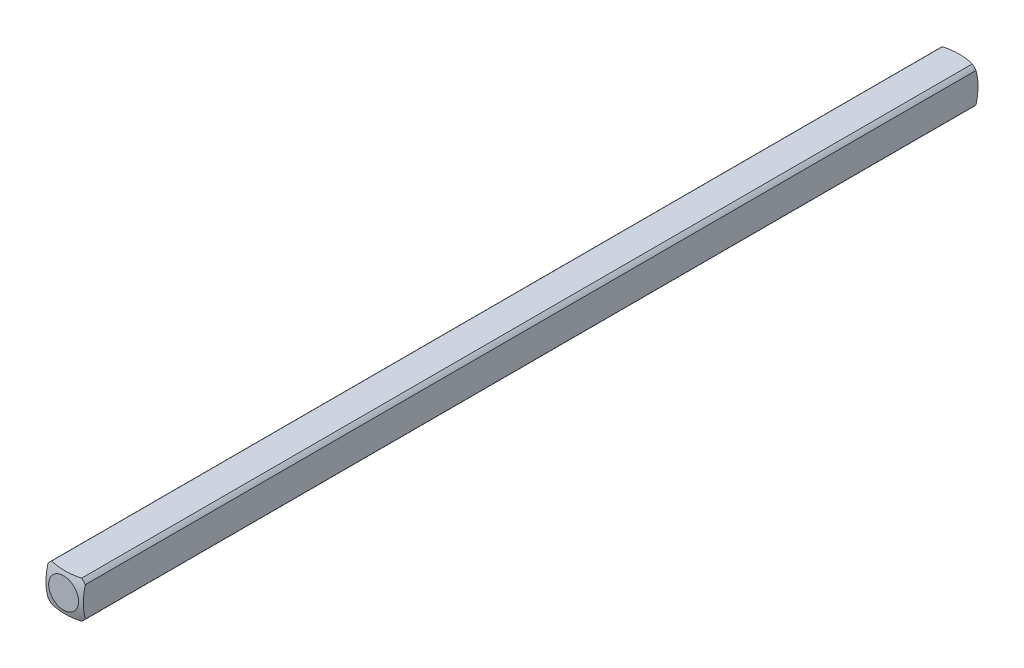
ISO-10303-21;
HEADER;
FILE_DESCRIPTION(('STEP AP214'),'2;1');
FILE_NAME('part.step','',(''),(''),'','','');
FILE_SCHEMA(('AUTOMOTIVE_DESIGN { 1 0 10303 214 1 1 1 1 }'));
ENDSEC;
DATA;
#1=APPLICATION_CONTEXT('core data for automotive mechanical design processes');
#2=APPLICATION_PROTOCOL_DEFINITION('international standard','automotive_design',2000,#1);
#3=PRODUCT_CONTEXT('',#1,'mechanical');
#4=PRODUCT('Part','Part','',(#3));
#5=PRODUCT_RELATED_PRODUCT_CATEGORY('part','',(#4));
#6=PRODUCT_DEFINITION_FORMATION('','',#4);
#7=PRODUCT_DEFINITION_CONTEXT('part definition',#1,'design');
#8=PRODUCT_DEFINITION('design','',#6,#7);
#9=PRODUCT_DEFINITION_SHAPE('','',#8);
#10=(LENGTH_UNIT() NAMED_UNIT(*) SI_UNIT(.MILLI.,.METRE.));
#11=(NAMED_UNIT(*) PLANE_ANGLE_UNIT() SI_UNIT($,.RADIAN.));
#12=(NAMED_UNIT(*) SI_UNIT($,.STERADIAN.) SOLID_ANGLE_UNIT());
#13=UNCERTAINTY_MEASURE_WITH_UNIT(LENGTH_MEASURE(1.E-05),#10,'distance_accuracy_value','');
#14=(GEOMETRIC_REPRESENTATION_CONTEXT(3) GLOBAL_UNCERTAINTY_ASSIGNED_CONTEXT((#13)) GLOBAL_UNIT_ASSIGNED_CONTEXT((#10,
#11,#12)) REPRESENTATION_CONTEXT('',''));
#15=CARTESIAN_POINT('',(0.,0.,0.));
#16=DIRECTION('',(0.,0.,1.));
#17=DIRECTION('',(1.,0.,0.));
#18=AXIS2_PLACEMENT_3D('',#15,#16,#17);
#19=CARTESIAN_POINT('',(-1.5875,-1.5875,38.1));
#20=DIRECTION('',(1.,0.,0.));
#21=DIRECTION('',(0.,0.,-1.));
#22=AXIS2_PLACEMENT_3D('',#19,#20,#21);
#23=PLANE('',#22);
#24=CARTESIAN_POINT('',(-1.5875,0.,4.91912226376204));
#25=DIRECTION('',(1.,0.,0.));
#26=DIRECTION('',(0.,0.,-1.));
#27=AXIS2_PLACEMENT_3D('',#24,#25,#26);
#28=CIRCLE('',#27,4.82558221875869);
#29=CARTESIAN_POINT('',(-1.5875,-1.26841150657032,0.263225357686905));
#30=VERTEX_POINT('',#29);
#31=CARTESIAN_POINT('',(-1.5875,1.26841150657032,0.263225357686935));
#32=VERTEX_POINT('',#31);
#33=EDGE_CURVE('E49',#30,#32,#28,.T.);
#34=ORIENTED_EDGE('',*,*,#33,.F.);
#35=DIRECTION('',(0.,0.,-1.));
#36=VECTOR('',#35,1.);
#37=CARTESIAN_POINT('',(-1.5875,-1.26841150657032,38.1));
#38=LINE('',#37,#36);
#39=CARTESIAN_POINT('',(-1.5875,-1.26841150657032,75.9367746423131));
#40=VERTEX_POINT('',#39);
#41=EDGE_CURVE('E42',#40,#30,#38,.T.);
#42=ORIENTED_EDGE('',*,*,#41,.F.);
#43=CARTESIAN_POINT('',(-1.5875,0.,71.280877736238));
#44=DIRECTION('',(-1.,0.,0.));
#45=DIRECTION('',(0.,0.,1.));
#46=AXIS2_PLACEMENT_3D('',#43,#44,#45);
#47=CIRCLE('',#46,4.82558221875869);
#48=CARTESIAN_POINT('',(-1.5875,1.26841150657032,75.9367746423131));
#49=VERTEX_POINT('',#48);
#50=EDGE_CURVE('E125',#40,#49,#47,.T.);
#51=ORIENTED_EDGE('',*,*,#50,.T.);
#52=DIRECTION('',(0.,0.,-1.));
#53=VECTOR('',#52,1.);
#54=CARTESIAN_POINT('',(-1.5875,1.26841150657032,38.1));
#55=LINE('',#54,#53);
#56=EDGE_CURVE('E113',#32,#49,#55,.F.);
#57=ORIENTED_EDGE('',*,*,#56,.F.);
#58=EDGE_LOOP('',(#34,#42,#51,#57));
#59=FACE_BOUND('',#58,.T.);
#60=ADVANCED_FACE('F35',(#59),#23,.F.);
#61=CARTESIAN_POINT('',(-1.5875,-1.5875,38.1));
#62=DIRECTION('',(0.,1.,0.));
#63=DIRECTION('',(0.,0.,1.));
#64=AXIS2_PLACEMENT_3D('',#61,#62,#63);
#65=PLANE('',#64);
#66=CARTESIAN_POINT('',(0.,-1.5875,4.91912226376204));
#67=DIRECTION('',(0.,1.,0.));
#68=DIRECTION('',(0.,0.,1.));
#69=AXIS2_PLACEMENT_3D('',#66,#67,#68);
#70=CIRCLE('',#69,4.82558221875869);
#71=CARTESIAN_POINT('',(1.26841150657032,-1.5875,0.263225357686905));
#72=VERTEX_POINT('',#71);
#73=CARTESIAN_POINT('',(-1.26841150657032,-1.5875,0.263225357686919));
#74=VERTEX_POINT('',#73);
#75=EDGE_CURVE('E154',#72,#74,#70,.T.);
#76=ORIENTED_EDGE('',*,*,#75,.F.);
#77=DIRECTION('',(0.,0.,-1.));
#78=VECTOR('',#77,1.);
#79=CARTESIAN_POINT('',(1.26841150657032,-1.5875,38.1));
#80=LINE('',#79,#78);
#81=CARTESIAN_POINT('',(1.26841150657032,-1.5875,75.9367746423131));
#82=VERTEX_POINT('',#81);
#83=EDGE_CURVE('E167',#82,#72,#80,.T.);
#84=ORIENTED_EDGE('',*,*,#83,.F.);
#85=CARTESIAN_POINT('',(0.,-1.5875,71.280877736238));
#86=DIRECTION('',(0.,-1.,0.));
#87=DIRECTION('',(0.,0.,-1.));
#88=AXIS2_PLACEMENT_3D('',#85,#86,#87);
#89=CIRCLE('',#88,4.82558221875869);
#90=CARTESIAN_POINT('',(-1.26841150657032,-1.5875,75.9367746423131));
#91=VERTEX_POINT('',#90);
#92=EDGE_CURVE('E136',#82,#91,#89,.T.);
#93=ORIENTED_EDGE('',*,*,#92,.T.);
#94=DIRECTION('',(0.,0.,-1.));
#95=VECTOR('',#94,1.);
#96=CARTESIAN_POINT('',(-1.26841150657032,-1.5875,38.1));
#97=LINE('',#96,#95);
#98=EDGE_CURVE('E165',#74,#91,#97,.F.);
#99=ORIENTED_EDGE('',*,*,#98,.F.);
#100=EDGE_LOOP('',(#76,#84,#93,#99));
#101=FACE_BOUND('',#100,.T.);
#102=ADVANCED_FACE('F177',(#101),#65,.F.);
#103=CARTESIAN_POINT('',(1.5875,-1.5875,38.1));
#104=DIRECTION('',(-1.,0.,0.));
#105=DIRECTION('',(0.,0.,1.));
#106=AXIS2_PLACEMENT_3D('',#103,#104,#105);
#107=PLANE('',#106);
#108=CARTESIAN_POINT('',(1.5875,0.,4.91912226376204));
#109=DIRECTION('',(-1.,0.,0.));
#110=DIRECTION('',(0.,0.,1.));
#111=AXIS2_PLACEMENT_3D('',#108,#109,#110);
#112=CIRCLE('',#111,4.82558221875869);
#113=CARTESIAN_POINT('',(1.5875,1.26841150657032,0.263225357686919));
#114=VERTEX_POINT('',#113);
#115=CARTESIAN_POINT('',(1.5875,-1.26841150657032,0.263225357686905));
#116=VERTEX_POINT('',#115);
#117=EDGE_CURVE('E152',#114,#116,#112,.T.);
#118=ORIENTED_EDGE('',*,*,#117,.F.);
#119=DIRECTION('',(0.,0.,-1.));
#120=VECTOR('',#119,1.);
#121=CARTESIAN_POINT('',(1.5875,1.26841150657032,38.1));
#122=LINE('',#121,#120);
#123=CARTESIAN_POINT('',(1.5875,1.26841150657032,75.9367746423131));
#124=VERTEX_POINT('',#123);
#125=EDGE_CURVE('E162',#124,#114,#122,.T.);
#126=ORIENTED_EDGE('',*,*,#125,.F.);
#127=CARTESIAN_POINT('',(1.5875,0.,71.280877736238));
#128=DIRECTION('',(1.,0.,0.));
#129=DIRECTION('',(0.,0.,-1.));
#130=AXIS2_PLACEMENT_3D('',#127,#128,#129);
#131=CIRCLE('',#130,4.82558221875869);
#132=CARTESIAN_POINT('',(1.5875,-1.26841150657032,75.9367746423131));
#133=VERTEX_POINT('',#132);
#134=EDGE_CURVE('E133',#124,#133,#131,.T.);
#135=ORIENTED_EDGE('',*,*,#134,.T.);
#136=DIRECTION('',(0.,0.,-1.));
#137=VECTOR('',#136,1.);
#138=CARTESIAN_POINT('',(1.5875,-1.26841150657032,38.1));
#139=LINE('',#138,#137);
#140=EDGE_CURVE('E106',#116,#133,#139,.F.);
#141=ORIENTED_EDGE('',*,*,#140,.F.);
#142=EDGE_LOOP('',(#118,#126,#135,#141));
#143=FACE_BOUND('',#142,.T.);
#144=ADVANCED_FACE('F184',(#143),#107,.F.);
#145=CARTESIAN_POINT('',(-1.5875,1.5875,38.1));
#146=DIRECTION('',(0.,-1.,0.));
#147=DIRECTION('',(0.,0.,-1.));
#148=AXIS2_PLACEMENT_3D('',#145,#146,#147);
#149=PLANE('',#148);
#150=CARTESIAN_POINT('',(0.,1.5875,4.91912226376204));
#151=DIRECTION('',(0.,-1.,0.));
#152=DIRECTION('',(0.,0.,-1.));
#153=AXIS2_PLACEMENT_3D('',#150,#151,#152);
#154=CIRCLE('',#153,4.82558221875869);
#155=CARTESIAN_POINT('',(-1.26841150657032,1.5875,0.263225357686919));
#156=VERTEX_POINT('',#155);
#157=CARTESIAN_POINT('',(1.26841150657032,1.5875,0.263225357686905));
#158=VERTEX_POINT('',#157);
#159=EDGE_CURVE('E104',#156,#158,#154,.T.);
#160=ORIENTED_EDGE('',*,*,#159,.F.);
#161=DIRECTION('',(0.,0.,-1.));
#162=VECTOR('',#161,1.);
#163=CARTESIAN_POINT('',(-1.26841150657032,1.5875,38.1));
#164=LINE('',#163,#162);
#165=CARTESIAN_POINT('',(-1.26841150657032,1.5875,75.9367746423131));
#166=VERTEX_POINT('',#165);
#167=EDGE_CURVE('E98',#166,#156,#164,.T.);
#168=ORIENTED_EDGE('',*,*,#167,.F.);
#169=CARTESIAN_POINT('',(0.,1.5875,71.280877736238));
#170=DIRECTION('',(0.,1.,0.));
#171=DIRECTION('',(0.,0.,1.));
#172=AXIS2_PLACEMENT_3D('',#169,#170,#171);
#173=CIRCLE('',#172,4.82558221875869);
#174=CARTESIAN_POINT('',(1.26841150657032,1.5875,75.9367746423131));
#175=VERTEX_POINT('',#174);
#176=EDGE_CURVE('E103',#166,#175,#173,.T.);
#177=ORIENTED_EDGE('',*,*,#176,.T.);
#178=DIRECTION('',(0.,0.,-1.));
#179=VECTOR('',#178,1.);
#180=CARTESIAN_POINT('',(1.26841150657032,1.5875,38.1));
#181=LINE('',#180,#179);
#182=EDGE_CURVE('E107',#158,#175,#181,.F.);
#183=ORIENTED_EDGE('',*,*,#182,.F.);
#184=EDGE_LOOP('',(#160,#168,#177,#183));
#185=FACE_BOUND('',#184,.T.);
#186=ADVANCED_FACE('F100',(#185),#149,.F.);
#187=CARTESIAN_POINT('',(0.,0.,38.1));
#188=DIRECTION('',(0.,0.,-1.));
#189=DIRECTION('',(-1.,0.,0.));
#190=AXIS2_PLACEMENT_3D('',#187,#188,#189);
#191=CYLINDRICAL_SURFACE('',#190,2.032);
#192=ORIENTED_EDGE('',*,*,#41,.T.);
#193=CARTESIAN_POINT('',(0.,0.,0.263225357686919));
#194=DIRECTION('',(0.,0.,1.));
#195=DIRECTION('',(1.,0.,0.));
#196=AXIS2_PLACEMENT_3D('',#193,#194,#195);
#197=CIRCLE('',#196,2.032);
#198=EDGE_CURVE('E149',#30,#74,#197,.T.);
#199=ORIENTED_EDGE('',*,*,#198,.T.);
#200=ORIENTED_EDGE('',*,*,#98,.T.);
#201=CARTESIAN_POINT('',(0.,0.,75.9367746423131));
#202=DIRECTION('',(0.,0.,1.));
#203=DIRECTION('',(1.,0.,0.));
#204=AXIS2_PLACEMENT_3D('',#201,#202,#203);
#205=CIRCLE('',#204,2.032);
#206=EDGE_CURVE('E130',#40,#91,#205,.T.);
#207=ORIENTED_EDGE('',*,*,#206,.F.);
#208=EDGE_LOOP('',(#192,#199,#200,#207));
#209=FACE_BOUND('',#208,.T.);
#210=ADVANCED_FACE('F173',(#209),#191,.T.);
#211=ORIENTED_EDGE('',*,*,#83,.T.);
#212=CARTESIAN_POINT('',(0.,0.,0.263225357686919));
#213=DIRECTION('',(0.,0.,1.));
#214=DIRECTION('',(1.,0.,0.));
#215=AXIS2_PLACEMENT_3D('',#212,#213,#214);
#216=CIRCLE('',#215,2.032);
#217=EDGE_CURVE('E55',#72,#116,#216,.T.);
#218=ORIENTED_EDGE('',*,*,#217,.T.);
#219=ORIENTED_EDGE('',*,*,#140,.T.);
#220=CARTESIAN_POINT('',(0.,0.,75.9367746423131));
#221=DIRECTION('',(0.,0.,1.));
#222=DIRECTION('',(1.,0.,0.));
#223=AXIS2_PLACEMENT_3D('',#220,#221,#222);
#224=CIRCLE('',#223,2.032);
#225=EDGE_CURVE('E139',#82,#133,#224,.T.);
#226=ORIENTED_EDGE('',*,*,#225,.F.);
#227=EDGE_LOOP('',(#211,#218,#219,#226));
#228=FACE_BOUND('',#227,.T.);
#229=ADVANCED_FACE('F180',(#228),#191,.T.);
#230=ORIENTED_EDGE('',*,*,#125,.T.);
#231=CARTESIAN_POINT('',(0.,0.,0.263225357686919));
#232=DIRECTION('',(0.,0.,1.));
#233=DIRECTION('',(1.,0.,0.));
#234=AXIS2_PLACEMENT_3D('',#231,#232,#233);
#235=CIRCLE('',#234,2.032);
#236=EDGE_CURVE('E146',#114,#158,#235,.T.);
#237=ORIENTED_EDGE('',*,*,#236,.T.);
#238=ORIENTED_EDGE('',*,*,#182,.T.);
#239=CARTESIAN_POINT('',(0.,0.,75.9367746423131));
#240=DIRECTION('',(0.,0.,1.));
#241=DIRECTION('',(1.,0.,0.));
#242=AXIS2_PLACEMENT_3D('',#239,#240,#241);
#243=CIRCLE('',#242,2.032);
#244=EDGE_CURVE('E124',#124,#175,#243,.T.);
#245=ORIENTED_EDGE('',*,*,#244,.F.);
#246=EDGE_LOOP('',(#230,#237,#238,#245));
#247=FACE_BOUND('',#246,.T.);
#248=ADVANCED_FACE('F186',(#247),#191,.T.);
#249=ORIENTED_EDGE('',*,*,#167,.T.);
#250=CARTESIAN_POINT('',(0.,0.,0.263225357686919));
#251=DIRECTION('',(0.,0.,1.));
#252=DIRECTION('',(1.,0.,0.));
#253=AXIS2_PLACEMENT_3D('',#250,#251,#252);
#254=CIRCLE('',#253,2.032);
#255=EDGE_CURVE('E12',#156,#32,#254,.T.);
#256=ORIENTED_EDGE('',*,*,#255,.T.);
#257=ORIENTED_EDGE('',*,*,#56,.T.);
#258=CARTESIAN_POINT('',(0.,0.,75.9367746423131));
#259=DIRECTION('',(0.,0.,1.));
#260=DIRECTION('',(1.,0.,0.));
#261=AXIS2_PLACEMENT_3D('',#258,#259,#260);
#262=CIRCLE('',#261,2.032);
#263=EDGE_CURVE('E110',#166,#49,#262,.T.);
#264=ORIENTED_EDGE('',*,*,#263,.F.);
#265=EDGE_LOOP('',(#249,#256,#257,#264));
#266=FACE_BOUND('',#265,.T.);
#267=ADVANCED_FACE('F111',(#266),#191,.T.);
#268=CARTESIAN_POINT('',(0.,0.,4.91912226376204));
#269=DIRECTION('',(0.,0.,1.));
#270=DIRECTION('',(-1.,0.,0.));
#271=AXIS2_PLACEMENT_3D('',#268,#269,#270);
#272=SPHERICAL_SURFACE('',#271,5.08);
#273=CARTESIAN_POINT('',(0.,0.,0.));
#274=DIRECTION('',(0.,0.,-1.));
#275=DIRECTION('',(-1.,0.,0.));
#276=AXIS2_PLACEMENT_3D('',#273,#274,#275);
#277=CIRCLE('',#276,1.26832020963187);
#278=CARTESIAN_POINT('',(-1.26832020963187,0.,0.));
#279=VERTEX_POINT('',#278);
#280=EDGE_CURVE('E157',#279,#279,#277,.T.);
#281=ORIENTED_EDGE('',*,*,#280,.F.);
#282=EDGE_LOOP('',(#281));
#283=FACE_BOUND('',#282,.T.);
#284=ORIENTED_EDGE('',*,*,#75,.T.);
#285=ORIENTED_EDGE('',*,*,#198,.F.);
#286=ORIENTED_EDGE('',*,*,#33,.T.);
#287=ORIENTED_EDGE('',*,*,#255,.F.);
#288=ORIENTED_EDGE('',*,*,#159,.T.);
#289=ORIENTED_EDGE('',*,*,#236,.F.);
#290=ORIENTED_EDGE('',*,*,#117,.T.);
#291=ORIENTED_EDGE('',*,*,#217,.F.);
#292=EDGE_LOOP('',(#284,#285,#286,#287,#288,#289,#290,#291));
#293=FACE_BOUND('',#292,.T.);
#294=ADVANCED_FACE('F187',(#283,#293),#272,.T.);
#295=CARTESIAN_POINT('',(0.,0.,0.));
#296=DIRECTION('',(0.,0.,-1.));
#297=DIRECTION('',(-1.,0.,0.));
#298=AXIS2_PLACEMENT_3D('',#295,#296,#297);
#299=PLANE('',#298);
#300=ORIENTED_EDGE('',*,*,#280,.T.);
#301=EDGE_LOOP('',(#300));
#302=FACE_BOUND('',#301,.T.);
#303=ADVANCED_FACE('F189',(#302),#299,.T.);
#304=CARTESIAN_POINT('',(0.,0.,71.280877736238));
#305=DIRECTION('',(0.,0.,-1.));
#306=DIRECTION('',(-1.,0.,0.));
#307=AXIS2_PLACEMENT_3D('',#304,#305,#306);
#308=SPHERICAL_SURFACE('',#307,5.08);
#309=CARTESIAN_POINT('',(0.,0.,76.2));
#310=DIRECTION('',(0.,0.,-1.));
#311=DIRECTION('',(-1.,0.,0.));
#312=AXIS2_PLACEMENT_3D('',#309,#310,#311);
#313=CIRCLE('',#312,1.26832020963187);
#314=CARTESIAN_POINT('',(-1.26832020963187,0.,76.2));
#315=VERTEX_POINT('',#314);
#316=EDGE_CURVE('E117',#315,#315,#313,.T.);
#317=ORIENTED_EDGE('',*,*,#316,.T.);
#318=EDGE_LOOP('',(#317));
#319=FACE_BOUND('',#318,.T.);
#320=ORIENTED_EDGE('',*,*,#92,.F.);
#321=ORIENTED_EDGE('',*,*,#225,.T.);
#322=ORIENTED_EDGE('',*,*,#134,.F.);
#323=ORIENTED_EDGE('',*,*,#244,.T.);
#324=ORIENTED_EDGE('',*,*,#176,.F.);
#325=ORIENTED_EDGE('',*,*,#263,.T.);
#326=ORIENTED_EDGE('',*,*,#50,.F.);
#327=ORIENTED_EDGE('',*,*,#206,.T.);
#328=EDGE_LOOP('',(#320,#321,#322,#323,#324,#325,#326,#327));
#329=FACE_BOUND('',#328,.T.);
#330=ADVANCED_FACE('F121',(#319,#329),#308,.T.);
#331=CARTESIAN_POINT('',(0.,0.,76.2));
#332=DIRECTION('',(0.,0.,1.));
#333=DIRECTION('',(-1.,0.,0.));
#334=AXIS2_PLACEMENT_3D('',#331,#332,#333);
#335=PLANE('',#334);
#336=ORIENTED_EDGE('',*,*,#316,.F.);
#337=EDGE_LOOP('',(#336));
#338=FACE_BOUND('',#337,.T.);
#339=ADVANCED_FACE('F234',(#338),#335,.T.);
#340=CLOSED_SHELL('',(#60,#102,#144,#186,#210,#229,#248,#267,#294,#303,#330,#339));
#341=MANIFOLD_SOLID_BREP('B2',#340);
#342=ADVANCED_BREP_SHAPE_REPRESENTATION('',(#18,#341),#14);
#343=SHAPE_DEFINITION_REPRESENTATION(#9,#342);
ENDSEC;
END-ISO-10303-21;
